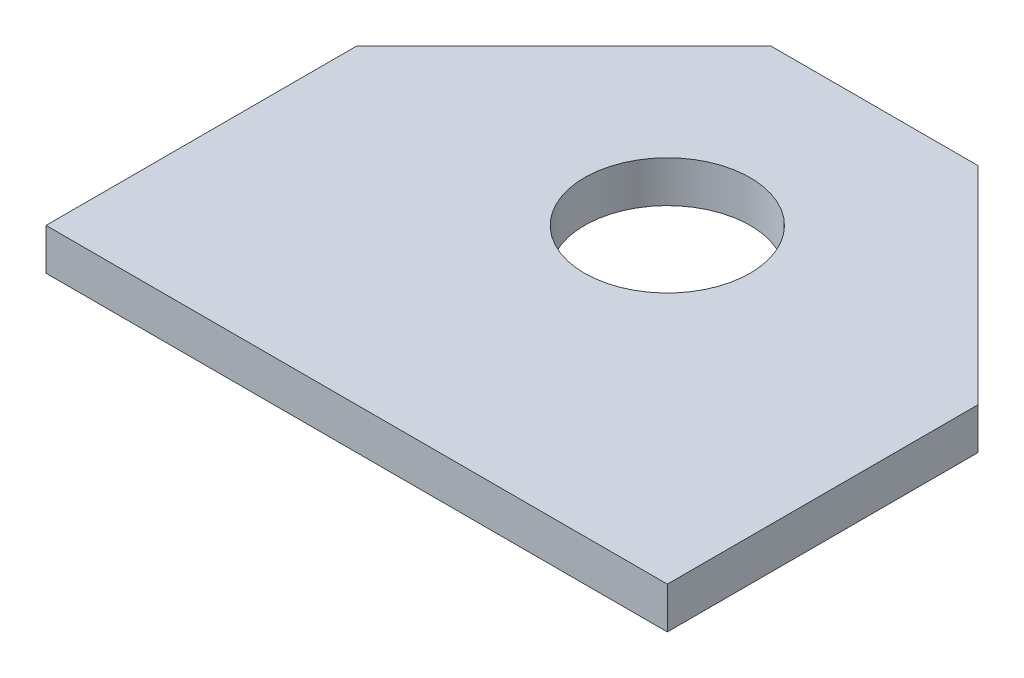
ISO-10303-21;
HEADER;
FILE_DESCRIPTION(('STEP AP214'),'2;1');
FILE_NAME('part.step','',(''),(''),'','','');
FILE_SCHEMA(('AUTOMOTIVE_DESIGN { 1 0 10303 214 1 1 1 1 }'));
ENDSEC;
DATA;
#1=APPLICATION_CONTEXT('core data for automotive mechanical design processes');
#2=APPLICATION_PROTOCOL_DEFINITION('international standard','automotive_design',2000,#1);
#3=PRODUCT_CONTEXT('',#1,'mechanical');
#4=PRODUCT('Part','Part','',(#3));
#5=PRODUCT_RELATED_PRODUCT_CATEGORY('part','',(#4));
#6=PRODUCT_DEFINITION_FORMATION('','',#4);
#7=PRODUCT_DEFINITION_CONTEXT('part definition',#1,'design');
#8=PRODUCT_DEFINITION('design','',#6,#7);
#9=PRODUCT_DEFINITION_SHAPE('','',#8);
#10=(LENGTH_UNIT() NAMED_UNIT(*) SI_UNIT(.MILLI.,.METRE.));
#11=(NAMED_UNIT(*) PLANE_ANGLE_UNIT() SI_UNIT($,.RADIAN.));
#12=(NAMED_UNIT(*) SI_UNIT($,.STERADIAN.) SOLID_ANGLE_UNIT());
#13=UNCERTAINTY_MEASURE_WITH_UNIT(LENGTH_MEASURE(1.E-05),#10,'distance_accuracy_value','');
#14=(GEOMETRIC_REPRESENTATION_CONTEXT(3) GLOBAL_UNCERTAINTY_ASSIGNED_CONTEXT((#13)) GLOBAL_UNIT_ASSIGNED_CONTEXT((#10,
#11,#12)) REPRESENTATION_CONTEXT('',''));
#15=CARTESIAN_POINT('',(0.,0.,0.));
#16=DIRECTION('',(0.,0.,1.));
#17=DIRECTION('',(1.,0.,0.));
#18=AXIS2_PLACEMENT_3D('',#15,#16,#17);
#19=CARTESIAN_POINT('',(0.,1.,0.));
#20=DIRECTION('',(0.,1.,0.));
#21=DIRECTION('',(0.,0.,1.));
#22=AXIS2_PLACEMENT_3D('',#19,#20,#21);
#23=PLANE('',#22);
#24=DIRECTION('',(-0.707106781186547,0.,0.707106781186548));
#25=VECTOR('',#24,1.);
#26=CARTESIAN_POINT('',(-5.,1.,-10.));
#27=LINE('',#26,#25);
#28=CARTESIAN_POINT('',(-5.,1.,-10.));
#29=VERTEX_POINT('',#28);
#30=CARTESIAN_POINT('',(-15.,1.,0.));
#31=VERTEX_POINT('',#30);
#32=EDGE_CURVE('E135',#29,#31,#27,.T.);
#33=ORIENTED_EDGE('',*,*,#32,.T.);
#34=DIRECTION('',(0.,0.,1.));
#35=VECTOR('',#34,1.);
#36=CARTESIAN_POINT('',(-15.,1.,0.));
#37=LINE('',#36,#35);
#38=CARTESIAN_POINT('',(-15.,1.,15.));
#39=VERTEX_POINT('',#38);
#40=EDGE_CURVE('E93',#31,#39,#37,.T.);
#41=ORIENTED_EDGE('',*,*,#40,.T.);
#42=DIRECTION('',(1.,0.,0.));
#43=VECTOR('',#42,1.);
#44=CARTESIAN_POINT('',(-15.,1.,15.));
#45=LINE('',#44,#43);
#46=CARTESIAN_POINT('',(15.,1.,15.));
#47=VERTEX_POINT('',#46);
#48=EDGE_CURVE('E106',#39,#47,#45,.T.);
#49=ORIENTED_EDGE('',*,*,#48,.T.);
#50=DIRECTION('',(0.,0.,-1.));
#51=VECTOR('',#50,1.);
#52=CARTESIAN_POINT('',(15.,1.,0.));
#53=LINE('',#52,#51);
#54=CARTESIAN_POINT('',(15.,1.,0.));
#55=VERTEX_POINT('',#54);
#56=EDGE_CURVE('E100',#47,#55,#53,.T.);
#57=ORIENTED_EDGE('',*,*,#56,.T.);
#58=DIRECTION('',(-0.707106781186546,0.,-0.707106781186549));
#59=VECTOR('',#58,1.);
#60=CARTESIAN_POINT('',(5.,1.,-10.));
#61=LINE('',#60,#59);
#62=CARTESIAN_POINT('',(5.,1.,-10.));
#63=VERTEX_POINT('',#62);
#64=EDGE_CURVE('E104',#55,#63,#61,.T.);
#65=ORIENTED_EDGE('',*,*,#64,.T.);
#66=DIRECTION('',(-1.,0.,0.));
#67=VECTOR('',#66,1.);
#68=CARTESIAN_POINT('',(5.,1.,-10.));
#69=LINE('',#68,#67);
#70=EDGE_CURVE('E56',#63,#29,#69,.T.);
#71=ORIENTED_EDGE('',*,*,#70,.T.);
#72=EDGE_LOOP('',(#33,#41,#49,#57,#65,#71));
#73=FACE_BOUND('',#72,.T.);
#74=CARTESIAN_POINT('',(0.,1.,0.));
#75=DIRECTION('',(0.,1.,0.));
#76=DIRECTION('',(0.,0.,1.));
#77=AXIS2_PLACEMENT_3D('',#74,#75,#76);
#78=CIRCLE('',#77,4.);
#79=CARTESIAN_POINT('',(0.,1.,4.));
#80=VERTEX_POINT('',#79);
#81=EDGE_CURVE('E128',#80,#80,#78,.T.);
#82=ORIENTED_EDGE('',*,*,#81,.F.);
#83=EDGE_LOOP('',(#82));
#84=FACE_BOUND('',#83,.T.);
#85=ADVANCED_FACE('F39',(#73,#84),#23,.T.);
#86=CARTESIAN_POINT('',(0.,-1.,0.));
#87=DIRECTION('',(0.,1.,0.));
#88=DIRECTION('',(0.,0.,1.));
#89=AXIS2_PLACEMENT_3D('',#86,#87,#88);
#90=PLANE('',#89);
#91=DIRECTION('',(-0.707106781186547,0.,0.707106781186548));
#92=VECTOR('',#91,1.);
#93=CARTESIAN_POINT('',(-5.,-1.,-10.));
#94=LINE('',#93,#92);
#95=CARTESIAN_POINT('',(-5.,-1.,-10.));
#96=VERTEX_POINT('',#95);
#97=CARTESIAN_POINT('',(-15.,-1.,0.));
#98=VERTEX_POINT('',#97);
#99=EDGE_CURVE('E124',#96,#98,#94,.T.);
#100=ORIENTED_EDGE('',*,*,#99,.F.);
#101=DIRECTION('',(-1.,0.,0.));
#102=VECTOR('',#101,1.);
#103=CARTESIAN_POINT('',(5.,-1.,-10.));
#104=LINE('',#103,#102);
#105=CARTESIAN_POINT('',(5.,-1.,-10.));
#106=VERTEX_POINT('',#105);
#107=EDGE_CURVE('E85',#106,#96,#104,.T.);
#108=ORIENTED_EDGE('',*,*,#107,.F.);
#109=DIRECTION('',(-0.707106781186546,0.,-0.707106781186549));
#110=VECTOR('',#109,1.);
#111=CARTESIAN_POINT('',(5.,-1.,-10.));
#112=LINE('',#111,#110);
#113=CARTESIAN_POINT('',(15.,-1.,0.));
#114=VERTEX_POINT('',#113);
#115=EDGE_CURVE('E79',#114,#106,#112,.T.);
#116=ORIENTED_EDGE('',*,*,#115,.F.);
#117=DIRECTION('',(0.,0.,-1.));
#118=VECTOR('',#117,1.);
#119=CARTESIAN_POINT('',(15.,-1.,0.));
#120=LINE('',#119,#118);
#121=CARTESIAN_POINT('',(15.,-1.,15.));
#122=VERTEX_POINT('',#121);
#123=EDGE_CURVE('E114',#122,#114,#120,.T.);
#124=ORIENTED_EDGE('',*,*,#123,.F.);
#125=DIRECTION('',(1.,0.,0.));
#126=VECTOR('',#125,1.);
#127=CARTESIAN_POINT('',(-15.,-1.,15.));
#128=LINE('',#127,#126);
#129=CARTESIAN_POINT('',(-15.,-1.,15.));
#130=VERTEX_POINT('',#129);
#131=EDGE_CURVE('E130',#130,#122,#128,.T.);
#132=ORIENTED_EDGE('',*,*,#131,.F.);
#133=DIRECTION('',(0.,0.,1.));
#134=VECTOR('',#133,1.);
#135=CARTESIAN_POINT('',(-15.,-1.,0.));
#136=LINE('',#135,#134);
#137=EDGE_CURVE('E127',#98,#130,#136,.T.);
#138=ORIENTED_EDGE('',*,*,#137,.F.);
#139=EDGE_LOOP('',(#100,#108,#116,#124,#132,#138));
#140=FACE_BOUND('',#139,.T.);
#141=CARTESIAN_POINT('',(0.,-1.,0.));
#142=DIRECTION('',(0.,1.,0.));
#143=DIRECTION('',(0.,0.,1.));
#144=AXIS2_PLACEMENT_3D('',#141,#142,#143);
#145=CIRCLE('',#144,4.);
#146=CARTESIAN_POINT('',(0.,-1.,4.));
#147=VERTEX_POINT('',#146);
#148=EDGE_CURVE('E210',#147,#147,#145,.T.);
#149=ORIENTED_EDGE('',*,*,#148,.T.);
#150=EDGE_LOOP('',(#149));
#151=FACE_BOUND('',#150,.T.);
#152=ADVANCED_FACE('F144',(#140,#151),#90,.F.);
#153=CARTESIAN_POINT('',(-5.,1.,-10.));
#154=DIRECTION('',(0.707106781186548,0.,0.707106781186547));
#155=DIRECTION('',(0.707106781186547,0.,-0.707106781186548));
#156=AXIS2_PLACEMENT_3D('',#153,#154,#155);
#157=PLANE('',#156);
#158=ORIENTED_EDGE('',*,*,#99,.T.);
#159=DIRECTION('',(0.,-1.,0.));
#160=VECTOR('',#159,1.);
#161=CARTESIAN_POINT('',(-15.,1.,0.));
#162=LINE('',#161,#160);
#163=EDGE_CURVE('E11',#31,#98,#162,.T.);
#164=ORIENTED_EDGE('',*,*,#163,.F.);
#165=ORIENTED_EDGE('',*,*,#32,.F.);
#166=DIRECTION('',(0.,-1.,0.));
#167=VECTOR('',#166,1.);
#168=CARTESIAN_POINT('',(-5.,1.,-10.));
#169=LINE('',#168,#167);
#170=EDGE_CURVE('E120',#29,#96,#169,.T.);
#171=ORIENTED_EDGE('',*,*,#170,.T.);
#172=EDGE_LOOP('',(#158,#164,#165,#171));
#173=FACE_BOUND('',#172,.T.);
#174=ADVANCED_FACE('F41',(#173),#157,.F.);
#175=CARTESIAN_POINT('',(-15.,1.,0.));
#176=DIRECTION('',(1.,0.,0.));
#177=DIRECTION('',(0.,0.,-1.));
#178=AXIS2_PLACEMENT_3D('',#175,#176,#177);
#179=PLANE('',#178);
#180=ORIENTED_EDGE('',*,*,#137,.T.);
#181=DIRECTION('',(0.,-1.,0.));
#182=VECTOR('',#181,1.);
#183=CARTESIAN_POINT('',(-15.,1.,15.));
#184=LINE('',#183,#182);
#185=EDGE_CURVE('E48',#39,#130,#184,.T.);
#186=ORIENTED_EDGE('',*,*,#185,.F.);
#187=ORIENTED_EDGE('',*,*,#40,.F.);
#188=ORIENTED_EDGE('',*,*,#163,.T.);
#189=EDGE_LOOP('',(#180,#186,#187,#188));
#190=FACE_BOUND('',#189,.T.);
#191=ADVANCED_FACE('F169',(#190),#179,.F.);
#192=CARTESIAN_POINT('',(-15.,1.,15.));
#193=DIRECTION('',(0.,0.,-1.));
#194=DIRECTION('',(-1.,0.,0.));
#195=AXIS2_PLACEMENT_3D('',#192,#193,#194);
#196=PLANE('',#195);
#197=ORIENTED_EDGE('',*,*,#131,.T.);
#198=DIRECTION('',(0.,-1.,0.));
#199=VECTOR('',#198,1.);
#200=CARTESIAN_POINT('',(15.,1.,15.));
#201=LINE('',#200,#199);
#202=EDGE_CURVE('E115',#47,#122,#201,.T.);
#203=ORIENTED_EDGE('',*,*,#202,.F.);
#204=ORIENTED_EDGE('',*,*,#48,.F.);
#205=ORIENTED_EDGE('',*,*,#185,.T.);
#206=EDGE_LOOP('',(#197,#203,#204,#205));
#207=FACE_BOUND('',#206,.T.);
#208=ADVANCED_FACE('F141',(#207),#196,.F.);
#209=CARTESIAN_POINT('',(15.,1.,0.));
#210=DIRECTION('',(-1.,0.,0.));
#211=DIRECTION('',(0.,0.,1.));
#212=AXIS2_PLACEMENT_3D('',#209,#210,#211);
#213=PLANE('',#212);
#214=ORIENTED_EDGE('',*,*,#123,.T.);
#215=DIRECTION('',(0.,-1.,0.));
#216=VECTOR('',#215,1.);
#217=CARTESIAN_POINT('',(15.,1.,0.));
#218=LINE('',#217,#216);
#219=EDGE_CURVE('E111',#55,#114,#218,.T.);
#220=ORIENTED_EDGE('',*,*,#219,.F.);
#221=ORIENTED_EDGE('',*,*,#56,.F.);
#222=ORIENTED_EDGE('',*,*,#202,.T.);
#223=EDGE_LOOP('',(#214,#220,#221,#222));
#224=FACE_BOUND('',#223,.T.);
#225=ADVANCED_FACE('F112',(#224),#213,.F.);
#226=CARTESIAN_POINT('',(5.,1.,-10.));
#227=DIRECTION('',(-0.707106781186549,0.,0.707106781186546));
#228=DIRECTION('',(0.707106781186546,0.,0.707106781186549));
#229=AXIS2_PLACEMENT_3D('',#226,#227,#228);
#230=PLANE('',#229);
#231=ORIENTED_EDGE('',*,*,#115,.T.);
#232=DIRECTION('',(0.,-1.,0.));
#233=VECTOR('',#232,1.);
#234=CARTESIAN_POINT('',(5.,1.,-10.));
#235=LINE('',#234,#233);
#236=EDGE_CURVE('E116',#63,#106,#235,.T.);
#237=ORIENTED_EDGE('',*,*,#236,.F.);
#238=ORIENTED_EDGE('',*,*,#64,.F.);
#239=ORIENTED_EDGE('',*,*,#219,.T.);
#240=EDGE_LOOP('',(#231,#237,#238,#239));
#241=FACE_BOUND('',#240,.T.);
#242=ADVANCED_FACE('F118',(#241),#230,.F.);
#243=CARTESIAN_POINT('',(5.,1.,-10.));
#244=DIRECTION('',(0.,0.,1.));
#245=DIRECTION('',(1.,0.,0.));
#246=AXIS2_PLACEMENT_3D('',#243,#244,#245);
#247=PLANE('',#246);
#248=ORIENTED_EDGE('',*,*,#107,.T.);
#249=ORIENTED_EDGE('',*,*,#170,.F.);
#250=ORIENTED_EDGE('',*,*,#70,.F.);
#251=ORIENTED_EDGE('',*,*,#236,.T.);
#252=EDGE_LOOP('',(#248,#249,#250,#251));
#253=FACE_BOUND('',#252,.T.);
#254=ADVANCED_FACE('F149',(#253),#247,.F.);
#255=CARTESIAN_POINT('',(0.,1.,0.));
#256=DIRECTION('',(0.,-1.,0.));
#257=DIRECTION('',(0.,0.,-1.));
#258=AXIS2_PLACEMENT_3D('',#255,#256,#257);
#259=CYLINDRICAL_SURFACE('',#258,4.);
#260=ORIENTED_EDGE('',*,*,#81,.T.);
#261=EDGE_LOOP('',(#260));
#262=FACE_BOUND('',#261,.T.);
#263=ORIENTED_EDGE('',*,*,#148,.F.);
#264=EDGE_LOOP('',(#263));
#265=FACE_BOUND('',#264,.T.);
#266=ADVANCED_FACE('F151',(#262,#265),#259,.F.);
#267=CLOSED_SHELL('',(#85,#152,#174,#191,#208,#225,#242,#254,#266));
#268=MANIFOLD_SOLID_BREP('B2',#267);
#269=ADVANCED_BREP_SHAPE_REPRESENTATION('',(#18,#268),#14);
#270=SHAPE_DEFINITION_REPRESENTATION(#9,#269);
ENDSEC;
END-ISO-10303-21;
